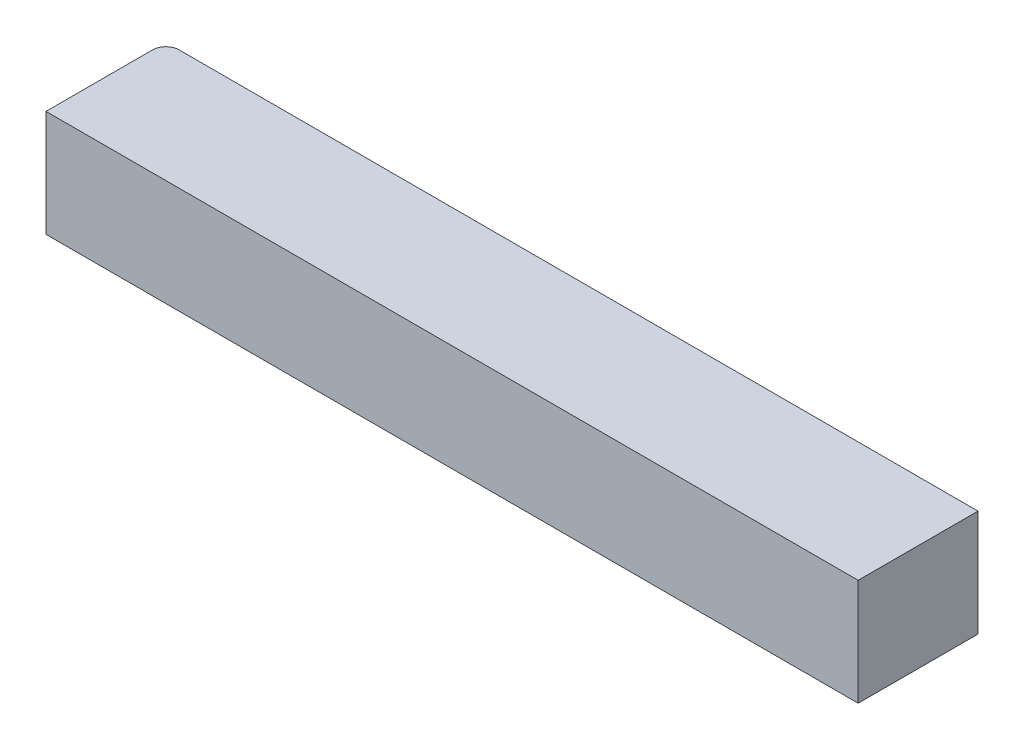
ISO-10303-21;
HEADER;
FILE_DESCRIPTION(('STEP AP214'),'2;1');
FILE_NAME('part.step','',(''),(''),'','','');
FILE_SCHEMA(('AUTOMOTIVE_DESIGN { 1 0 10303 214 1 1 1 1 }'));
ENDSEC;
DATA;
#1=APPLICATION_CONTEXT('core data for automotive mechanical design processes');
#2=APPLICATION_PROTOCOL_DEFINITION('international standard','automotive_design',2000,#1);
#3=PRODUCT_CONTEXT('',#1,'mechanical');
#4=PRODUCT('Part','Part','',(#3));
#5=PRODUCT_RELATED_PRODUCT_CATEGORY('part','',(#4));
#6=PRODUCT_DEFINITION_FORMATION('','',#4);
#7=PRODUCT_DEFINITION_CONTEXT('part definition',#1,'design');
#8=PRODUCT_DEFINITION('design','',#6,#7);
#9=PRODUCT_DEFINITION_SHAPE('','',#8);
#10=(LENGTH_UNIT() NAMED_UNIT(*) SI_UNIT(.MILLI.,.METRE.));
#11=(NAMED_UNIT(*) PLANE_ANGLE_UNIT() SI_UNIT($,.RADIAN.));
#12=(NAMED_UNIT(*) SI_UNIT($,.STERADIAN.) SOLID_ANGLE_UNIT());
#13=UNCERTAINTY_MEASURE_WITH_UNIT(LENGTH_MEASURE(1.E-05),#10,'distance_accuracy_value','');
#14=(GEOMETRIC_REPRESENTATION_CONTEXT(3) GLOBAL_UNCERTAINTY_ASSIGNED_CONTEXT((#13)) GLOBAL_UNIT_ASSIGNED_CONTEXT((#10,
#11,#12)) REPRESENTATION_CONTEXT('',''));
#15=CARTESIAN_POINT('',(0.,0.,0.));
#16=DIRECTION('',(0.,0.,1.));
#17=DIRECTION('',(1.,0.,0.));
#18=AXIS2_PLACEMENT_3D('',#15,#16,#17);
#19=CARTESIAN_POINT('',(30.5,8.,-4.5));
#20=DIRECTION('',(-1.,0.,0.));
#21=DIRECTION('',(0.,0.,1.));
#22=AXIS2_PLACEMENT_3D('',#19,#20,#21);
#23=PLANE('',#22);
#24=DIRECTION('',(0.,0.,-1.));
#25=VECTOR('',#24,1.);
#26=CARTESIAN_POINT('',(30.5,0.,-4.5));
#27=LINE('',#26,#25);
#28=CARTESIAN_POINT('',(30.5,0.,4.5));
#29=VERTEX_POINT('',#28);
#30=CARTESIAN_POINT('',(30.5,0.,-4.5));
#31=VERTEX_POINT('',#30);
#32=EDGE_CURVE('E106',#29,#31,#27,.T.);
#33=ORIENTED_EDGE('',*,*,#32,.T.);
#34=DIRECTION('',(0.,-1.,0.));
#35=VECTOR('',#34,1.);
#36=CARTESIAN_POINT('',(30.5,8.,-4.5));
#37=LINE('',#36,#35);
#38=CARTESIAN_POINT('',(30.5,8.,-4.5));
#39=VERTEX_POINT('',#38);
#40=EDGE_CURVE('E11',#39,#31,#37,.T.);
#41=ORIENTED_EDGE('',*,*,#40,.F.);
#42=DIRECTION('',(0.,0.,-1.));
#43=VECTOR('',#42,1.);
#44=CARTESIAN_POINT('',(30.5,8.,-4.5));
#45=LINE('',#44,#43);
#46=CARTESIAN_POINT('',(30.5,8.,4.5));
#47=VERTEX_POINT('',#46);
#48=EDGE_CURVE('E114',#47,#39,#45,.T.);
#49=ORIENTED_EDGE('',*,*,#48,.F.);
#50=DIRECTION('',(0.,-1.,0.));
#51=VECTOR('',#50,1.);
#52=CARTESIAN_POINT('',(30.5,8.,4.5));
#53=LINE('',#52,#51);
#54=EDGE_CURVE('E102',#47,#29,#53,.T.);
#55=ORIENTED_EDGE('',*,*,#54,.T.);
#56=EDGE_LOOP('',(#33,#41,#49,#55));
#57=FACE_BOUND('',#56,.T.);
#58=ADVANCED_FACE('F32',(#57),#23,.F.);
#59=CARTESIAN_POINT('',(-29.5,8.,-4.5));
#60=DIRECTION('',(0.,0.,1.));
#61=DIRECTION('',(1.,0.,0.));
#62=AXIS2_PLACEMENT_3D('',#59,#60,#61);
#63=PLANE('',#62);
#64=DIRECTION('',(-1.,0.,0.));
#65=VECTOR('',#64,1.);
#66=CARTESIAN_POINT('',(-29.5,0.,-4.5));
#67=LINE('',#66,#65);
#68=CARTESIAN_POINT('',(-29.5,0.,-4.5));
#69=VERTEX_POINT('',#68);
#70=EDGE_CURVE('E109',#31,#69,#67,.T.);
#71=ORIENTED_EDGE('',*,*,#70,.T.);
#72=DIRECTION('',(0.,-1.,0.));
#73=VECTOR('',#72,1.);
#74=CARTESIAN_POINT('',(-29.5,8.,-4.5));
#75=LINE('',#74,#73);
#76=CARTESIAN_POINT('',(-29.5,8.,-4.5));
#77=VERTEX_POINT('',#76);
#78=EDGE_CURVE('E40',#77,#69,#75,.T.);
#79=ORIENTED_EDGE('',*,*,#78,.F.);
#80=DIRECTION('',(-1.,0.,0.));
#81=VECTOR('',#80,1.);
#82=CARTESIAN_POINT('',(-29.5,8.,-4.5));
#83=LINE('',#82,#81);
#84=EDGE_CURVE('E82',#39,#77,#83,.T.);
#85=ORIENTED_EDGE('',*,*,#84,.F.);
#86=ORIENTED_EDGE('',*,*,#40,.T.);
#87=EDGE_LOOP('',(#71,#79,#85,#86));
#88=FACE_BOUND('',#87,.T.);
#89=ADVANCED_FACE('F133',(#88),#63,.F.);
#90=CARTESIAN_POINT('',(-29.5,8.,-3.5));
#91=DIRECTION('',(0.,-1.,0.));
#92=DIRECTION('',(0.,0.,-1.));
#93=AXIS2_PLACEMENT_3D('',#90,#91,#92);
#94=CYLINDRICAL_SURFACE('',#93,1.);
#95=CARTESIAN_POINT('',(-29.5,0.,-3.5));
#96=DIRECTION('',(0.,1.,0.));
#97=DIRECTION('',(0.,0.,-1.));
#98=AXIS2_PLACEMENT_3D('',#95,#96,#97);
#99=CIRCLE('',#98,1.);
#100=CARTESIAN_POINT('',(-30.5,0.,-3.5));
#101=VERTEX_POINT('',#100);
#102=EDGE_CURVE('E97',#69,#101,#99,.T.);
#103=ORIENTED_EDGE('',*,*,#102,.T.);
#104=DIRECTION('',(0.,-1.,0.));
#105=VECTOR('',#104,1.);
#106=CARTESIAN_POINT('',(-30.5,8.,-3.5));
#107=LINE('',#106,#105);
#108=CARTESIAN_POINT('',(-30.5,8.,-3.5));
#109=VERTEX_POINT('',#108);
#110=EDGE_CURVE('E94',#109,#101,#107,.T.);
#111=ORIENTED_EDGE('',*,*,#110,.F.);
#112=CARTESIAN_POINT('',(-29.5,8.,-3.5));
#113=DIRECTION('',(0.,1.,0.));
#114=DIRECTION('',(0.,0.,-1.));
#115=AXIS2_PLACEMENT_3D('',#112,#113,#114);
#116=CIRCLE('',#115,1.);
#117=EDGE_CURVE('E86',#77,#109,#116,.T.);
#118=ORIENTED_EDGE('',*,*,#117,.F.);
#119=ORIENTED_EDGE('',*,*,#78,.T.);
#120=EDGE_LOOP('',(#103,#111,#118,#119));
#121=FACE_BOUND('',#120,.T.);
#122=ADVANCED_FACE('F95',(#121),#94,.T.);
#123=CARTESIAN_POINT('',(-30.5,8.,-3.5));
#124=DIRECTION('',(1.,0.,0.));
#125=DIRECTION('',(0.,0.,-1.));
#126=AXIS2_PLACEMENT_3D('',#123,#124,#125);
#127=PLANE('',#126);
#128=DIRECTION('',(0.,0.,1.));
#129=VECTOR('',#128,1.);
#130=CARTESIAN_POINT('',(-30.5,0.,-3.5));
#131=LINE('',#130,#129);
#132=CARTESIAN_POINT('',(-30.5,0.,4.5));
#133=VERTEX_POINT('',#132);
#134=EDGE_CURVE('E68',#101,#133,#131,.T.);
#135=ORIENTED_EDGE('',*,*,#134,.T.);
#136=DIRECTION('',(0.,-1.,0.));
#137=VECTOR('',#136,1.);
#138=CARTESIAN_POINT('',(-30.5,8.,4.5));
#139=LINE('',#138,#137);
#140=CARTESIAN_POINT('',(-30.5,8.,4.5));
#141=VERTEX_POINT('',#140);
#142=EDGE_CURVE('E98',#141,#133,#139,.T.);
#143=ORIENTED_EDGE('',*,*,#142,.F.);
#144=DIRECTION('',(0.,0.,1.));
#145=VECTOR('',#144,1.);
#146=CARTESIAN_POINT('',(-30.5,8.,-3.5));
#147=LINE('',#146,#145);
#148=EDGE_CURVE('E90',#109,#141,#147,.T.);
#149=ORIENTED_EDGE('',*,*,#148,.F.);
#150=ORIENTED_EDGE('',*,*,#110,.T.);
#151=EDGE_LOOP('',(#135,#143,#149,#150));
#152=FACE_BOUND('',#151,.T.);
#153=ADVANCED_FACE('F100',(#152),#127,.F.);
#154=CARTESIAN_POINT('',(-30.5,8.,4.5));
#155=DIRECTION('',(0.,0.,-1.));
#156=DIRECTION('',(-1.,0.,0.));
#157=AXIS2_PLACEMENT_3D('',#154,#155,#156);
#158=PLANE('',#157);
#159=DIRECTION('',(1.,0.,0.));
#160=VECTOR('',#159,1.);
#161=CARTESIAN_POINT('',(-30.5,0.,4.5));
#162=LINE('',#161,#160);
#163=EDGE_CURVE('E74',#133,#29,#162,.T.);
#164=ORIENTED_EDGE('',*,*,#163,.T.);
#165=ORIENTED_EDGE('',*,*,#54,.F.);
#166=DIRECTION('',(1.,0.,0.));
#167=VECTOR('',#166,1.);
#168=CARTESIAN_POINT('',(-30.5,8.,4.5));
#169=LINE('',#168,#167);
#170=EDGE_CURVE('E48',#141,#47,#169,.T.);
#171=ORIENTED_EDGE('',*,*,#170,.F.);
#172=ORIENTED_EDGE('',*,*,#142,.T.);
#173=EDGE_LOOP('',(#164,#165,#171,#172));
#174=FACE_BOUND('',#173,.T.);
#175=ADVANCED_FACE('F122',(#174),#158,.F.);
#176=CARTESIAN_POINT('',(-29.5,8.,-3.5));
#177=DIRECTION('',(0.,-1.,0.));
#178=DIRECTION('',(0.,0.,-1.));
#179=AXIS2_PLACEMENT_3D('',#176,#177,#178);
#180=PLANE('',#179);
#181=ORIENTED_EDGE('',*,*,#48,.T.);
#182=ORIENTED_EDGE('',*,*,#84,.T.);
#183=ORIENTED_EDGE('',*,*,#117,.T.);
#184=ORIENTED_EDGE('',*,*,#148,.T.);
#185=ORIENTED_EDGE('',*,*,#170,.T.);
#186=EDGE_LOOP('',(#181,#182,#183,#184,#185));
#187=FACE_BOUND('',#186,.T.);
#188=ADVANCED_FACE('F88',(#187),#180,.F.);
#189=CARTESIAN_POINT('',(-29.5,0.,-3.5));
#190=DIRECTION('',(0.,-1.,0.));
#191=DIRECTION('',(0.,0.,-1.));
#192=AXIS2_PLACEMENT_3D('',#189,#190,#191);
#193=PLANE('',#192);
#194=ORIENTED_EDGE('',*,*,#32,.F.);
#195=ORIENTED_EDGE('',*,*,#163,.F.);
#196=ORIENTED_EDGE('',*,*,#134,.F.);
#197=ORIENTED_EDGE('',*,*,#102,.F.);
#198=ORIENTED_EDGE('',*,*,#70,.F.);
#199=EDGE_LOOP('',(#194,#195,#196,#197,#198));
#200=FACE_BOUND('',#199,.T.);
#201=ADVANCED_FACE('F118',(#200),#193,.T.);
#202=CLOSED_SHELL('',(#58,#89,#122,#153,#175,#188,#201));
#203=MANIFOLD_SOLID_BREP('B2',#202);
#204=ADVANCED_BREP_SHAPE_REPRESENTATION('',(#18,#203),#14);
#205=SHAPE_DEFINITION_REPRESENTATION(#9,#204);
ENDSEC;
END-ISO-10303-21;
